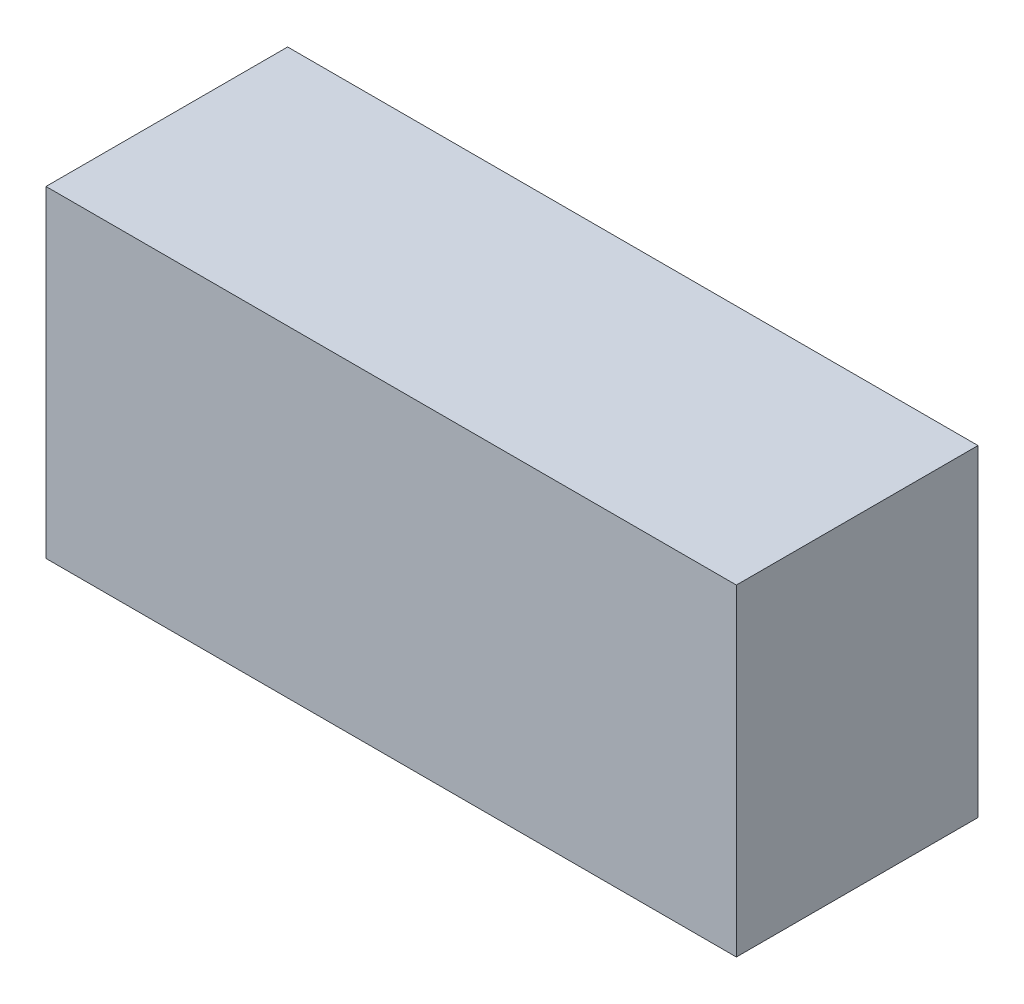
ISO-10303-21;
HEADER;
FILE_DESCRIPTION(('STEP AP214'),'2;1');
FILE_NAME('part.step','',(''),(''),'','','');
FILE_SCHEMA(('AUTOMOTIVE_DESIGN { 1 0 10303 214 1 1 1 1 }'));
ENDSEC;
DATA;
#1=APPLICATION_CONTEXT('core data for automotive mechanical design processes');
#2=APPLICATION_PROTOCOL_DEFINITION('international standard','automotive_design',2000,#1);
#3=PRODUCT_CONTEXT('',#1,'mechanical');
#4=PRODUCT('Part','Part','',(#3));
#5=PRODUCT_RELATED_PRODUCT_CATEGORY('part','',(#4));
#6=PRODUCT_DEFINITION_FORMATION('','',#4);
#7=PRODUCT_DEFINITION_CONTEXT('part definition',#1,'design');
#8=PRODUCT_DEFINITION('design','',#6,#7);
#9=PRODUCT_DEFINITION_SHAPE('','',#8);
#10=(LENGTH_UNIT() NAMED_UNIT(*) SI_UNIT(.MILLI.,.METRE.));
#11=(NAMED_UNIT(*) PLANE_ANGLE_UNIT() SI_UNIT($,.RADIAN.));
#12=(NAMED_UNIT(*) SI_UNIT($,.STERADIAN.) SOLID_ANGLE_UNIT());
#13=UNCERTAINTY_MEASURE_WITH_UNIT(LENGTH_MEASURE(1.E-05),#10,'distance_accuracy_value','');
#14=(GEOMETRIC_REPRESENTATION_CONTEXT(3) GLOBAL_UNCERTAINTY_ASSIGNED_CONTEXT((#13)) GLOBAL_UNIT_ASSIGNED_CONTEXT((#10,
#11,#12)) REPRESENTATION_CONTEXT('',''));
#15=CARTESIAN_POINT('',(0.,0.,0.));
#16=DIRECTION('',(0.,0.,1.));
#17=DIRECTION('',(1.,0.,0.));
#18=AXIS2_PLACEMENT_3D('',#15,#16,#17);
#19=CARTESIAN_POINT('',(-1.49999954,-0.6999986,1.05000044));
#20=DIRECTION('',(0.,0.,-1.));
#21=DIRECTION('',(-1.,0.,0.));
#22=AXIS2_PLACEMENT_3D('',#19,#20,#21);
#23=PLANE('',#22);
#24=DIRECTION('',(0.,1.,0.));
#25=VECTOR('',#24,1.);
#26=CARTESIAN_POINT('',(1.49999954,-0.6999986,1.05000044));
#27=LINE('',#26,#25);
#28=CARTESIAN_POINT('',(1.49999954,-0.6999986,1.05000044));
#29=VERTEX_POINT('',#28);
#30=CARTESIAN_POINT('',(1.49999954,0.70000114,1.05000044));
#31=VERTEX_POINT('',#30);
#32=EDGE_CURVE('E55',#29,#31,#27,.T.);
#33=ORIENTED_EDGE('',*,*,#32,.T.);
#34=DIRECTION('',(1.,0.,0.));
#35=VECTOR('',#34,1.);
#36=CARTESIAN_POINT('',(1.49999954,0.70000114,1.05000044));
#37=LINE('',#36,#35);
#38=CARTESIAN_POINT('',(-1.49999954,0.70000114,1.05000044));
#39=VERTEX_POINT('',#38);
#40=EDGE_CURVE('E57',#31,#39,#37,.F.);
#41=ORIENTED_EDGE('',*,*,#40,.T.);
#42=DIRECTION('',(0.,1.,0.));
#43=VECTOR('',#42,1.);
#44=CARTESIAN_POINT('',(-1.49999954,0.70000114,1.05000044));
#45=LINE('',#44,#43);
#46=CARTESIAN_POINT('',(-1.49999954,-0.6999986,1.05000044));
#47=VERTEX_POINT('',#46);
#48=EDGE_CURVE('E20',#39,#47,#45,.F.);
#49=ORIENTED_EDGE('',*,*,#48,.T.);
#50=DIRECTION('',(1.,0.,0.));
#51=VECTOR('',#50,1.);
#52=CARTESIAN_POINT('',(-1.49999954,-0.6999986,1.05000044));
#53=LINE('',#52,#51);
#54=EDGE_CURVE('E80',#47,#29,#53,.T.);
#55=ORIENTED_EDGE('',*,*,#54,.T.);
#56=EDGE_LOOP('',(#33,#41,#49,#55));
#57=FACE_BOUND('',#56,.T.);
#58=ADVANCED_FACE('F17',(#57),#23,.F.);
#59=CARTESIAN_POINT('',(-1.49999954,0.70000114,0.));
#60=DIRECTION('',(1.,0.,0.));
#61=DIRECTION('',(0.,0.,-1.));
#62=AXIS2_PLACEMENT_3D('',#59,#60,#61);
#63=PLANE('',#62);
#64=DIRECTION('',(0.,0.,1.));
#65=VECTOR('',#64,1.);
#66=CARTESIAN_POINT('',(-1.49999954,-0.6999986,0.));
#67=LINE('',#66,#65);
#68=CARTESIAN_POINT('',(-1.49999954,-0.6999986,0.));
#69=VERTEX_POINT('',#68);
#70=EDGE_CURVE('E68',#69,#47,#67,.T.);
#71=ORIENTED_EDGE('',*,*,#70,.T.);
#72=ORIENTED_EDGE('',*,*,#48,.F.);
#73=DIRECTION('',(0.,0.,-1.));
#74=VECTOR('',#73,1.);
#75=CARTESIAN_POINT('',(-1.49999954,0.70000114,0.));
#76=LINE('',#75,#74);
#77=CARTESIAN_POINT('',(-1.49999954,0.70000114,0.));
#78=VERTEX_POINT('',#77);
#79=EDGE_CURVE('E63',#39,#78,#76,.T.);
#80=ORIENTED_EDGE('',*,*,#79,.T.);
#81=DIRECTION('',(0.,1.,0.));
#82=VECTOR('',#81,1.);
#83=CARTESIAN_POINT('',(-1.49999954,-0.6999986,0.));
#84=LINE('',#83,#82);
#85=EDGE_CURVE('E83',#69,#78,#84,.T.);
#86=ORIENTED_EDGE('',*,*,#85,.F.);
#87=EDGE_LOOP('',(#71,#72,#80,#86));
#88=FACE_BOUND('',#87,.T.);
#89=ADVANCED_FACE('F65',(#88),#63,.F.);
#90=CARTESIAN_POINT('',(1.49999954,0.70000114,0.));
#91=DIRECTION('',(0.,-1.,0.));
#92=DIRECTION('',(0.,0.,-1.));
#93=AXIS2_PLACEMENT_3D('',#90,#91,#92);
#94=PLANE('',#93);
#95=ORIENTED_EDGE('',*,*,#79,.F.);
#96=ORIENTED_EDGE('',*,*,#40,.F.);
#97=DIRECTION('',(0.,0.,1.));
#98=VECTOR('',#97,1.);
#99=CARTESIAN_POINT('',(1.49999954,0.70000114,0.));
#100=LINE('',#99,#98);
#101=CARTESIAN_POINT('',(1.49999954,0.70000114,0.));
#102=VERTEX_POINT('',#101);
#103=EDGE_CURVE('E75',#31,#102,#100,.F.);
#104=ORIENTED_EDGE('',*,*,#103,.T.);
#105=DIRECTION('',(-1.,0.,0.));
#106=VECTOR('',#105,1.);
#107=CARTESIAN_POINT('',(-1.49999954,0.70000114,0.));
#108=LINE('',#107,#106);
#109=EDGE_CURVE('E72',#78,#102,#108,.F.);
#110=ORIENTED_EDGE('',*,*,#109,.F.);
#111=EDGE_LOOP('',(#95,#96,#104,#110));
#112=FACE_BOUND('',#111,.T.);
#113=ADVANCED_FACE('F70',(#112),#94,.F.);
#114=CARTESIAN_POINT('',(1.49999954,-0.6999986,0.));
#115=DIRECTION('',(-1.,0.,0.));
#116=DIRECTION('',(0.,0.,1.));
#117=AXIS2_PLACEMENT_3D('',#114,#115,#116);
#118=PLANE('',#117);
#119=ORIENTED_EDGE('',*,*,#103,.F.);
#120=ORIENTED_EDGE('',*,*,#32,.F.);
#121=DIRECTION('',(0.,0.,1.));
#122=VECTOR('',#121,1.);
#123=CARTESIAN_POINT('',(1.49999954,-0.6999986,0.));
#124=LINE('',#123,#122);
#125=CARTESIAN_POINT('',(1.49999954,-0.6999986,0.));
#126=VERTEX_POINT('',#125);
#127=EDGE_CURVE('E35',#29,#126,#124,.F.);
#128=ORIENTED_EDGE('',*,*,#127,.T.);
#129=DIRECTION('',(0.,1.,0.));
#130=VECTOR('',#129,1.);
#131=CARTESIAN_POINT('',(1.49999954,-0.6999986,0.));
#132=LINE('',#131,#130);
#133=EDGE_CURVE('E26',#102,#126,#132,.F.);
#134=ORIENTED_EDGE('',*,*,#133,.F.);
#135=EDGE_LOOP('',(#119,#120,#128,#134));
#136=FACE_BOUND('',#135,.T.);
#137=ADVANCED_FACE('F89',(#136),#118,.F.);
#138=CARTESIAN_POINT('',(-1.49999954,-0.6999986,0.));
#139=DIRECTION('',(0.,1.,0.));
#140=DIRECTION('',(0.,0.,1.));
#141=AXIS2_PLACEMENT_3D('',#138,#139,#140);
#142=PLANE('',#141);
#143=ORIENTED_EDGE('',*,*,#127,.F.);
#144=ORIENTED_EDGE('',*,*,#54,.F.);
#145=ORIENTED_EDGE('',*,*,#70,.F.);
#146=DIRECTION('',(-1.,0.,0.));
#147=VECTOR('',#146,1.);
#148=CARTESIAN_POINT('',(-1.49999954,-0.6999986,0.));
#149=LINE('',#148,#147);
#150=EDGE_CURVE('E11',#126,#69,#149,.T.);
#151=ORIENTED_EDGE('',*,*,#150,.F.);
#152=EDGE_LOOP('',(#143,#144,#145,#151));
#153=FACE_BOUND('',#152,.T.);
#154=ADVANCED_FACE('F91',(#153),#142,.F.);
#155=CARTESIAN_POINT('',(-1.49999954,-0.6999986,0.));
#156=DIRECTION('',(0.,0.,-1.));
#157=DIRECTION('',(-1.,0.,0.));
#158=AXIS2_PLACEMENT_3D('',#155,#156,#157);
#159=PLANE('',#158);
#160=ORIENTED_EDGE('',*,*,#133,.T.);
#161=ORIENTED_EDGE('',*,*,#150,.T.);
#162=ORIENTED_EDGE('',*,*,#85,.T.);
#163=ORIENTED_EDGE('',*,*,#109,.T.);
#164=EDGE_LOOP('',(#160,#161,#162,#163));
#165=FACE_BOUND('',#164,.T.);
#166=ADVANCED_FACE('F88',(#165),#159,.T.);
#167=CLOSED_SHELL('',(#58,#89,#113,#137,#154,#166));
#168=MANIFOLD_SOLID_BREP('B1',#167);
#169=ADVANCED_BREP_SHAPE_REPRESENTATION('',(#18,#168),#14);
#170=SHAPE_DEFINITION_REPRESENTATION(#9,#169);
ENDSEC;
END-ISO-10303-21;
